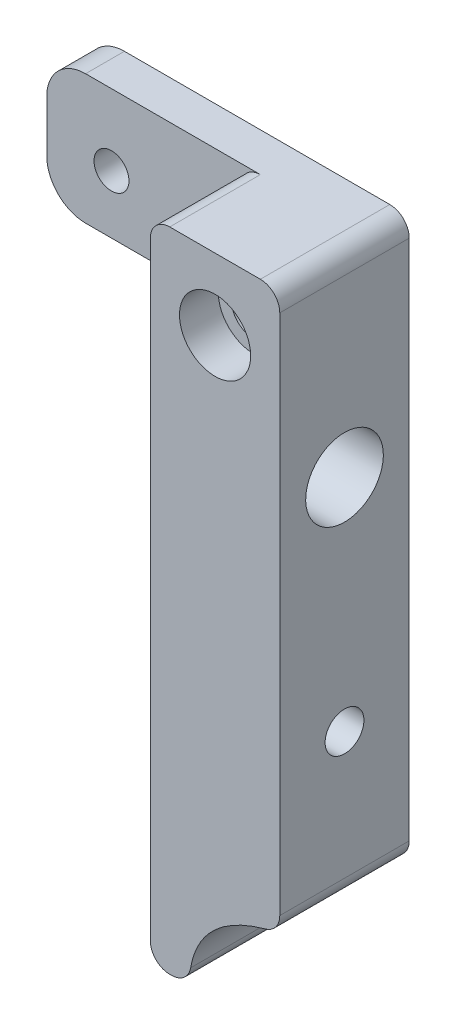
ISO-10303-21;
HEADER;
FILE_DESCRIPTION(('STEP AP214'),'2;1');
FILE_NAME('part.step','',(''),(''),'','','');
FILE_SCHEMA(('AUTOMOTIVE_DESIGN { 1 0 10303 214 1 1 1 1 }'));
ENDSEC;
DATA;
#1=APPLICATION_CONTEXT('core data for automotive mechanical design processes');
#2=APPLICATION_PROTOCOL_DEFINITION('international standard','automotive_design',2000,#1);
#3=PRODUCT_CONTEXT('',#1,'mechanical');
#4=PRODUCT('Part','Part','',(#3));
#5=PRODUCT_RELATED_PRODUCT_CATEGORY('part','',(#4));
#6=PRODUCT_DEFINITION_FORMATION('','',#4);
#7=PRODUCT_DEFINITION_CONTEXT('part definition',#1,'design');
#8=PRODUCT_DEFINITION('design','',#6,#7);
#9=PRODUCT_DEFINITION_SHAPE('','',#8);
#10=(LENGTH_UNIT() NAMED_UNIT(*) SI_UNIT(.MILLI.,.METRE.));
#11=(NAMED_UNIT(*) PLANE_ANGLE_UNIT() SI_UNIT($,.RADIAN.));
#12=(NAMED_UNIT(*) SI_UNIT($,.STERADIAN.) SOLID_ANGLE_UNIT());
#13=UNCERTAINTY_MEASURE_WITH_UNIT(LENGTH_MEASURE(1.E-05),#10,'distance_accuracy_value','');
#14=(GEOMETRIC_REPRESENTATION_CONTEXT(3) GLOBAL_UNCERTAINTY_ASSIGNED_CONTEXT((#13)) GLOBAL_UNIT_ASSIGNED_CONTEXT((#10,
#11,#12)) REPRESENTATION_CONTEXT('',''));
#15=CARTESIAN_POINT('',(0.,0.,0.));
#16=DIRECTION('',(0.,0.,1.));
#17=DIRECTION('',(1.,0.,0.));
#18=AXIS2_PLACEMENT_3D('',#15,#16,#17);
#19=CARTESIAN_POINT('',(-5.,25.,10.));
#20=DIRECTION('',(1.,0.,0.));
#21=DIRECTION('',(0.,1.,0.));
#22=AXIS2_PLACEMENT_3D('',#19,#20,#21);
#23=PLANE('',#22);
#24=CARTESIAN_POINT('',(-5.,-6.99999999999999,5.));
#25=DIRECTION('',(1.,0.,0.));
#26=DIRECTION('',(0.,1.,0.));
#27=AXIS2_PLACEMENT_3D('',#24,#25,#26);
#28=CIRCLE('',#27,1.5);
#29=CARTESIAN_POINT('',(-5.,-5.49999999999999,5.));
#30=VERTEX_POINT('',#29);
#31=EDGE_CURVE('E394',#30,#30,#28,.T.);
#32=ORIENTED_EDGE('',*,*,#31,.T.);
#33=EDGE_LOOP('',(#32));
#34=FACE_BOUND('',#33,.T.);
#35=CARTESIAN_POINT('',(-5.,10.,5.));
#36=DIRECTION('',(1.,0.,0.));
#37=DIRECTION('',(0.,1.,0.));
#38=AXIS2_PLACEMENT_3D('',#35,#36,#37);
#39=CIRCLE('',#38,3.);
#40=CARTESIAN_POINT('',(-5.,13.,5.));
#41=VERTEX_POINT('',#40);
#42=EDGE_CURVE('E183',#41,#41,#39,.T.);
#43=ORIENTED_EDGE('',*,*,#42,.T.);
#44=EDGE_LOOP('',(#43));
#45=FACE_BOUND('',#44,.T.);
#46=DIRECTION('',(0.,-1.,0.));
#47=VECTOR('',#46,1.);
#48=CARTESIAN_POINT('',(-5.,25.,10.));
#49=LINE('',#48,#47);
#50=CARTESIAN_POINT('',(-5.,23.5,10.));
#51=VERTEX_POINT('',#50);
#52=CARTESIAN_POINT('',(-5.,-23.5,10.));
#53=VERTEX_POINT('',#52);
#54=EDGE_CURVE('E291',#51,#53,#49,.T.);
#55=ORIENTED_EDGE('',*,*,#54,.F.);
#56=DIRECTION('',(0.,0.,-1.));
#57=VECTOR('',#56,1.);
#58=CARTESIAN_POINT('',(-5.,23.5,10.));
#59=LINE('',#58,#57);
#60=CARTESIAN_POINT('',(-5.,23.5,3.));
#61=VERTEX_POINT('',#60);
#62=EDGE_CURVE('E287',#51,#61,#59,.T.);
#63=ORIENTED_EDGE('',*,*,#62,.T.);
#64=DIRECTION('',(0.,1.,0.));
#65=VECTOR('',#64,1.);
#66=CARTESIAN_POINT('',(-5.,25.,3.));
#67=LINE('',#66,#65);
#68=CARTESIAN_POINT('',(-5.,15.,3.));
#69=VERTEX_POINT('',#68);
#70=EDGE_CURVE('E167',#69,#61,#67,.T.);
#71=ORIENTED_EDGE('',*,*,#70,.F.);
#72=DIRECTION('',(0.,0.,1.));
#73=VECTOR('',#72,1.);
#74=CARTESIAN_POINT('',(-5.,15.,0.));
#75=LINE('',#74,#73);
#76=CARTESIAN_POINT('',(-5.,15.,0.));
#77=VERTEX_POINT('',#76);
#78=EDGE_CURVE('E143',#77,#69,#75,.T.);
#79=ORIENTED_EDGE('',*,*,#78,.F.);
#80=DIRECTION('',(0.,-1.,0.));
#81=VECTOR('',#80,1.);
#82=CARTESIAN_POINT('',(-5.,25.,0.));
#83=LINE('',#82,#81);
#84=CARTESIAN_POINT('',(-5.,-23.5,0.));
#85=VERTEX_POINT('',#84);
#86=EDGE_CURVE('E152',#77,#85,#83,.T.);
#87=ORIENTED_EDGE('',*,*,#86,.T.);
#88=DIRECTION('',(0.,0.,-1.));
#89=VECTOR('',#88,1.);
#90=CARTESIAN_POINT('',(-5.,-23.5,10.));
#91=LINE('',#90,#89);
#92=EDGE_CURVE('E294',#85,#53,#91,.F.);
#93=ORIENTED_EDGE('',*,*,#92,.T.);
#94=EDGE_LOOP('',(#55,#63,#71,#79,#87,#93));
#95=FACE_BOUND('',#94,.T.);
#96=ADVANCED_FACE('F32',(#34,#45,#95),#23,.F.);
#97=CARTESIAN_POINT('',(0.,19.5,0.));
#98=DIRECTION('',(0.,0.,1.));
#99=DIRECTION('',(1.,0.,0.));
#100=AXIS2_PLACEMENT_3D('',#97,#98,#99);
#101=CYLINDRICAL_SURFACE('',#100,1.75);
#102=CARTESIAN_POINT('',(0.,19.5,0.));
#103=DIRECTION('',(0.,0.,1.));
#104=DIRECTION('',(1.,0.,0.));
#105=AXIS2_PLACEMENT_3D('',#102,#103,#104);
#106=CIRCLE('',#105,1.75);
#107=CARTESIAN_POINT('',(1.75,19.5,0.));
#108=VERTEX_POINT('',#107);
#109=EDGE_CURVE('E197',#108,#108,#106,.T.);
#110=ORIENTED_EDGE('',*,*,#109,.F.);
#111=EDGE_LOOP('',(#110));
#112=FACE_BOUND('',#111,.T.);
#113=CARTESIAN_POINT('',(0.,19.5,7.));
#114=DIRECTION('',(0.,0.,1.));
#115=DIRECTION('',(1.,0.,0.));
#116=AXIS2_PLACEMENT_3D('',#113,#114,#115);
#117=CIRCLE('',#116,1.75);
#118=CARTESIAN_POINT('',(1.75,19.5,7.));
#119=VERTEX_POINT('',#118);
#120=EDGE_CURVE('E187',#119,#119,#117,.F.);
#121=ORIENTED_EDGE('',*,*,#120,.F.);
#122=EDGE_LOOP('',(#121));
#123=FACE_BOUND('',#122,.T.);
#124=ADVANCED_FACE('F214',(#112,#123),#101,.F.);
#125=CARTESIAN_POINT('',(5.,25.,10.));
#126=DIRECTION('',(-1.,0.,0.));
#127=DIRECTION('',(0.,-1.,0.));
#128=AXIS2_PLACEMENT_3D('',#125,#126,#127);
#129=PLANE('',#128);
#130=CARTESIAN_POINT('',(5.,-6.99999999999999,5.));
#131=DIRECTION('',(1.,0.,0.));
#132=DIRECTION('',(0.,1.,0.));
#133=AXIS2_PLACEMENT_3D('',#130,#131,#132);
#134=CIRCLE('',#133,1.5);
#135=CARTESIAN_POINT('',(5.,-5.49999999999999,5.));
#136=VERTEX_POINT('',#135);
#137=EDGE_CURVE('E391',#136,#136,#134,.T.);
#138=ORIENTED_EDGE('',*,*,#137,.F.);
#139=EDGE_LOOP('',(#138));
#140=FACE_BOUND('',#139,.T.);
#141=CARTESIAN_POINT('',(5.,10.,5.));
#142=DIRECTION('',(1.,0.,0.));
#143=DIRECTION('',(0.,1.,0.));
#144=AXIS2_PLACEMENT_3D('',#141,#142,#143);
#145=CIRCLE('',#144,3.);
#146=CARTESIAN_POINT('',(5.,13.,5.));
#147=VERTEX_POINT('',#146);
#148=EDGE_CURVE('E148',#147,#147,#145,.T.);
#149=ORIENTED_EDGE('',*,*,#148,.F.);
#150=EDGE_LOOP('',(#149));
#151=FACE_BOUND('',#150,.T.);
#152=DIRECTION('',(0.,1.,0.));
#153=VECTOR('',#152,1.);
#154=CARTESIAN_POINT('',(5.,25.,10.));
#155=LINE('',#154,#153);
#156=CARTESIAN_POINT('',(5.,-16.8205775806911,10.));
#157=VERTEX_POINT('',#156);
#158=CARTESIAN_POINT('',(5.,23.5,10.));
#159=VERTEX_POINT('',#158);
#160=EDGE_CURVE('E345',#157,#159,#155,.T.);
#161=ORIENTED_EDGE('',*,*,#160,.F.);
#162=DIRECTION('',(0.,0.,1.));
#163=VECTOR('',#162,1.);
#164=CARTESIAN_POINT('',(5.,-16.8205775806911,10.));
#165=LINE('',#164,#163);
#166=CARTESIAN_POINT('',(5.,-16.8205775806911,0.));
#167=VERTEX_POINT('',#166);
#168=EDGE_CURVE('E327',#157,#167,#165,.F.);
#169=ORIENTED_EDGE('',*,*,#168,.T.);
#170=DIRECTION('',(0.,1.,0.));
#171=VECTOR('',#170,1.);
#172=CARTESIAN_POINT('',(5.,25.,0.));
#173=LINE('',#172,#171);
#174=CARTESIAN_POINT('',(5.,23.5,0.));
#175=VERTEX_POINT('',#174);
#176=EDGE_CURVE('E349',#167,#175,#173,.T.);
#177=ORIENTED_EDGE('',*,*,#176,.T.);
#178=DIRECTION('',(0.,0.,-1.));
#179=VECTOR('',#178,1.);
#180=CARTESIAN_POINT('',(5.,23.5,10.));
#181=LINE('',#180,#179);
#182=EDGE_CURVE('E329',#175,#159,#181,.F.);
#183=ORIENTED_EDGE('',*,*,#182,.T.);
#184=EDGE_LOOP('',(#161,#169,#177,#183));
#185=FACE_BOUND('',#184,.T.);
#186=ADVANCED_FACE('F217',(#140,#151,#185),#129,.F.);
#187=CARTESIAN_POINT('',(-5.,25.,10.));
#188=DIRECTION('',(0.,-1.,0.));
#189=DIRECTION('',(0.,0.,-1.));
#190=AXIS2_PLACEMENT_3D('',#187,#188,#189);
#191=PLANE('',#190);
#192=DIRECTION('',(1.,0.,0.));
#193=VECTOR('',#192,1.);
#194=CARTESIAN_POINT('',(-20.,25.,3.));
#195=LINE('',#194,#193);
#196=CARTESIAN_POINT('',(-17.,25.,3.));
#197=VERTEX_POINT('',#196);
#198=CARTESIAN_POINT('',(-3.5,25.,3.));
#199=VERTEX_POINT('',#198);
#200=EDGE_CURVE('E47',#197,#199,#195,.T.);
#201=ORIENTED_EDGE('',*,*,#200,.T.);
#202=DIRECTION('',(0.,0.,-1.));
#203=VECTOR('',#202,1.);
#204=CARTESIAN_POINT('',(-3.5,25.,10.));
#205=LINE('',#204,#203);
#206=CARTESIAN_POINT('',(-3.5,25.,10.));
#207=VERTEX_POINT('',#206);
#208=EDGE_CURVE('E51',#199,#207,#205,.F.);
#209=ORIENTED_EDGE('',*,*,#208,.T.);
#210=DIRECTION('',(-1.,0.,0.));
#211=VECTOR('',#210,1.);
#212=CARTESIAN_POINT('',(-5.,25.,10.));
#213=LINE('',#212,#211);
#214=CARTESIAN_POINT('',(3.5,25.,10.));
#215=VERTEX_POINT('',#214);
#216=EDGE_CURVE('E292',#215,#207,#213,.T.);
#217=ORIENTED_EDGE('',*,*,#216,.F.);
#218=DIRECTION('',(0.,0.,-1.));
#219=VECTOR('',#218,1.);
#220=CARTESIAN_POINT('',(3.5,25.,10.));
#221=LINE('',#220,#219);
#222=CARTESIAN_POINT('',(3.5,25.,0.));
#223=VERTEX_POINT('',#222);
#224=EDGE_CURVE('E305',#215,#223,#221,.T.);
#225=ORIENTED_EDGE('',*,*,#224,.T.);
#226=DIRECTION('',(-1.,0.,0.));
#227=VECTOR('',#226,1.);
#228=CARTESIAN_POINT('',(-5.,25.,0.));
#229=LINE('',#228,#227);
#230=CARTESIAN_POINT('',(-17.,25.,0.));
#231=VERTEX_POINT('',#230);
#232=EDGE_CURVE('E161',#223,#231,#229,.T.);
#233=ORIENTED_EDGE('',*,*,#232,.T.);
#234=DIRECTION('',(0.,0.,-1.));
#235=VECTOR('',#234,1.);
#236=CARTESIAN_POINT('',(-17.,25.,3.));
#237=LINE('',#236,#235);
#238=EDGE_CURVE('E275',#231,#197,#237,.F.);
#239=ORIENTED_EDGE('',*,*,#238,.T.);
#240=EDGE_LOOP('',(#201,#209,#217,#225,#233,#239));
#241=FACE_BOUND('',#240,.T.);
#242=ADVANCED_FACE('F229',(#241),#191,.F.);
#243=CARTESIAN_POINT('',(-5.,-25.,10.));
#244=DIRECTION('',(0.,1.,0.));
#245=DIRECTION('',(0.,0.,1.));
#246=AXIS2_PLACEMENT_3D('',#243,#244,#245);
#247=PLANE('',#246);
#248=DIRECTION('',(1.,0.,0.));
#249=VECTOR('',#248,1.);
#250=CARTESIAN_POINT('',(-5.,-25.,0.));
#251=LINE('',#250,#249);
#252=CARTESIAN_POINT('',(-3.5,-25.,0.));
#253=VERTEX_POINT('',#252);
#254=CARTESIAN_POINT('',(-3.36282393672585,-25.,0.));
#255=VERTEX_POINT('',#254);
#256=EDGE_CURVE('E160',#253,#255,#251,.T.);
#257=ORIENTED_EDGE('',*,*,#256,.T.);
#258=DIRECTION('',(0.,0.,1.));
#259=VECTOR('',#258,1.);
#260=CARTESIAN_POINT('',(-3.36282393672585,-25.,10.));
#261=LINE('',#260,#259);
#262=CARTESIAN_POINT('',(-3.36282393672585,-25.,10.));
#263=VERTEX_POINT('',#262);
#264=EDGE_CURVE('E314',#255,#263,#261,.T.);
#265=ORIENTED_EDGE('',*,*,#264,.T.);
#266=DIRECTION('',(1.,0.,0.));
#267=VECTOR('',#266,1.);
#268=CARTESIAN_POINT('',(-5.,-25.,10.));
#269=LINE('',#268,#267);
#270=CARTESIAN_POINT('',(-3.5,-25.,10.));
#271=VERTEX_POINT('',#270);
#272=EDGE_CURVE('E296',#271,#263,#269,.T.);
#273=ORIENTED_EDGE('',*,*,#272,.F.);
#274=DIRECTION('',(0.,0.,-1.));
#275=VECTOR('',#274,1.);
#276=CARTESIAN_POINT('',(-3.5,-25.,10.));
#277=LINE('',#276,#275);
#278=EDGE_CURVE('E317',#271,#253,#277,.T.);
#279=ORIENTED_EDGE('',*,*,#278,.T.);
#280=EDGE_LOOP('',(#257,#265,#273,#279));
#281=FACE_BOUND('',#280,.T.);
#282=ADVANCED_FACE('F222',(#281),#247,.F.);
#283=CARTESIAN_POINT('',(0.,0.,10.));
#284=DIRECTION('',(0.,0.,1.));
#285=DIRECTION('',(1.,0.,0.));
#286=AXIS2_PLACEMENT_3D('',#283,#284,#285);
#287=PLANE('',#286);
#288=CARTESIAN_POINT('',(0.,19.5,10.));
#289=DIRECTION('',(0.,0.,1.));
#290=DIRECTION('',(1.,0.,0.));
#291=AXIS2_PLACEMENT_3D('',#288,#289,#290);
#292=CIRCLE('',#291,2.75);
#293=CARTESIAN_POINT('',(2.75,19.5,10.));
#294=VERTEX_POINT('',#293);
#295=EDGE_CURVE('E188',#294,#294,#292,.T.);
#296=ORIENTED_EDGE('',*,*,#295,.F.);
#297=EDGE_LOOP('',(#296));
#298=FACE_BOUND('',#297,.T.);
#299=ORIENTED_EDGE('',*,*,#216,.T.);
#300=CARTESIAN_POINT('',(-3.5,23.5,10.));
#301=DIRECTION('',(0.,0.,1.));
#302=DIRECTION('',(1.,0.,0.));
#303=AXIS2_PLACEMENT_3D('',#300,#301,#302);
#304=CIRCLE('',#303,1.5);
#305=EDGE_CURVE('E40',#207,#51,#304,.T.);
#306=ORIENTED_EDGE('',*,*,#305,.T.);
#307=ORIENTED_EDGE('',*,*,#54,.T.);
#308=CARTESIAN_POINT('',(-3.5,-23.5,10.));
#309=DIRECTION('',(0.,0.,1.));
#310=DIRECTION('',(1.,0.,0.));
#311=AXIS2_PLACEMENT_3D('',#308,#309,#310);
#312=CIRCLE('',#311,1.5);
#313=EDGE_CURVE('E335',#53,#271,#312,.T.);
#314=ORIENTED_EDGE('',*,*,#313,.T.);
#315=ORIENTED_EDGE('',*,*,#272,.T.);
#316=CARTESIAN_POINT('',(-3.36282393672585,-23.5,10.));
#317=DIRECTION('',(0.,0.,1.));
#318=DIRECTION('',(1.,0.,0.));
#319=AXIS2_PLACEMENT_3D('',#316,#317,#318);
#320=CIRCLE('',#319,1.5);
#321=CARTESIAN_POINT('',(-1.88522685811019,-23.7582767377571,10.));
#322=VERTEX_POINT('',#321);
#323=EDGE_CURVE('E333',#263,#322,#320,.T.);
#324=ORIENTED_EDGE('',*,*,#323,.T.);
#325=CARTESIAN_POINT('',(5.,-18.,10.));
#326=CARTESIAN_POINT('',(-1.90422484156133,-19.4309354552699,10.));
#327=CARTESIAN_POINT('',(-2.,-25.,10.));
#328=B_SPLINE_CURVE_WITH_KNOTS('',2,(#325,#326,#327),.UNSPECIFIED.,.F.,.F.,(3,3),(0.,1.),.UNSPECIFIED.);
#329=CARTESIAN_POINT('',(3.90400517645005,-18.2651466574062,10.));
#330=VERTEX_POINT('',#329);
#331=EDGE_CURVE('E198',#330,#322,#328,.T.);
#332=ORIENTED_EDGE('',*,*,#331,.F.);
#333=CARTESIAN_POINT('',(3.5,-16.8205775806911,10.));
#334=DIRECTION('',(0.,0.,1.));
#335=DIRECTION('',(1.,0.,0.));
#336=AXIS2_PLACEMENT_3D('',#333,#334,#335);
#337=CIRCLE('',#336,1.5);
#338=EDGE_CURVE('E331',#330,#157,#337,.T.);
#339=ORIENTED_EDGE('',*,*,#338,.T.);
#340=ORIENTED_EDGE('',*,*,#160,.T.);
#341=CARTESIAN_POINT('',(3.5,23.5,10.));
#342=DIRECTION('',(0.,0.,1.));
#343=DIRECTION('',(1.,0.,0.));
#344=AXIS2_PLACEMENT_3D('',#341,#342,#343);
#345=CIRCLE('',#344,1.5);
#346=EDGE_CURVE('E337',#159,#215,#345,.T.);
#347=ORIENTED_EDGE('',*,*,#346,.T.);
#348=EDGE_LOOP('',(#299,#306,#307,#314,#315,#324,#332,#339,#340,#347));
#349=FACE_BOUND('',#348,.T.);
#350=ADVANCED_FACE('F219',(#298,#349),#287,.T.);
#351=CARTESIAN_POINT('',(0.,0.,0.));
#352=DIRECTION('',(0.,0.,1.));
#353=DIRECTION('',(1.,0.,0.));
#354=AXIS2_PLACEMENT_3D('',#351,#352,#353);
#355=PLANE('',#354);
#356=CARTESIAN_POINT('',(-15.,19.5,0.));
#357=DIRECTION('',(0.,0.,1.));
#358=DIRECTION('',(1.,0.,0.));
#359=AXIS2_PLACEMENT_3D('',#356,#357,#358);
#360=CIRCLE('',#359,1.35);
#361=CARTESIAN_POINT('',(-13.65,19.5,0.));
#362=VERTEX_POINT('',#361);
#363=EDGE_CURVE('E168',#362,#362,#360,.T.);
#364=ORIENTED_EDGE('',*,*,#363,.T.);
#365=EDGE_LOOP('',(#364));
#366=FACE_BOUND('',#365,.T.);
#367=ORIENTED_EDGE('',*,*,#109,.T.);
#368=EDGE_LOOP('',(#367));
#369=FACE_BOUND('',#368,.T.);
#370=DIRECTION('',(0.,-1.,0.));
#371=VECTOR('',#370,1.);
#372=CARTESIAN_POINT('',(-20.,25.,0.));
#373=LINE('',#372,#371);
#374=CARTESIAN_POINT('',(-20.,22.,0.));
#375=VERTEX_POINT('',#374);
#376=CARTESIAN_POINT('',(-20.,18.,0.));
#377=VERTEX_POINT('',#376);
#378=EDGE_CURVE('E170',#375,#377,#373,.T.);
#379=ORIENTED_EDGE('',*,*,#378,.F.);
#380=CARTESIAN_POINT('',(-17.,22.,0.));
#381=DIRECTION('',(0.,0.,1.));
#382=DIRECTION('',(1.,0.,0.));
#383=AXIS2_PLACEMENT_3D('',#380,#381,#382);
#384=CIRCLE('',#383,3.);
#385=EDGE_CURVE('E272',#375,#231,#384,.F.);
#386=ORIENTED_EDGE('',*,*,#385,.T.);
#387=ORIENTED_EDGE('',*,*,#232,.F.);
#388=CARTESIAN_POINT('',(3.5,23.5,0.));
#389=DIRECTION('',(0.,0.,1.));
#390=DIRECTION('',(1.,0.,0.));
#391=AXIS2_PLACEMENT_3D('',#388,#389,#390);
#392=CIRCLE('',#391,1.5);
#393=EDGE_CURVE('E325',#223,#175,#392,.F.);
#394=ORIENTED_EDGE('',*,*,#393,.T.);
#395=ORIENTED_EDGE('',*,*,#176,.F.);
#396=CARTESIAN_POINT('',(3.5,-16.8205775806911,0.));
#397=DIRECTION('',(0.,0.,1.));
#398=DIRECTION('',(1.,0.,0.));
#399=AXIS2_PLACEMENT_3D('',#396,#397,#398);
#400=CIRCLE('',#399,1.5);
#401=CARTESIAN_POINT('',(3.90400517645005,-18.2651466574062,0.));
#402=VERTEX_POINT('',#401);
#403=EDGE_CURVE('E320',#167,#402,#400,.F.);
#404=ORIENTED_EDGE('',*,*,#403,.T.);
#405=CARTESIAN_POINT('',(5.,-18.,0.));
#406=CARTESIAN_POINT('',(-1.90422484156133,-19.4309354552699,0.));
#407=CARTESIAN_POINT('',(-2.,-25.,0.));
#408=B_SPLINE_CURVE_WITH_KNOTS('',2,(#405,#406,#407),.UNSPECIFIED.,.F.,.F.,(3,3),(0.,1.),.UNSPECIFIED.);
#409=CARTESIAN_POINT('',(-1.88522685811019,-23.7582767377571,0.));
#410=VERTEX_POINT('',#409);
#411=EDGE_CURVE('E191',#402,#410,#408,.T.);
#412=ORIENTED_EDGE('',*,*,#411,.T.);
#413=CARTESIAN_POINT('',(-3.36282393672585,-23.5,0.));
#414=DIRECTION('',(0.,0.,1.));
#415=DIRECTION('',(1.,0.,0.));
#416=AXIS2_PLACEMENT_3D('',#413,#414,#415);
#417=CIRCLE('',#416,1.5);
#418=EDGE_CURVE('E322',#410,#255,#417,.F.);
#419=ORIENTED_EDGE('',*,*,#418,.T.);
#420=ORIENTED_EDGE('',*,*,#256,.F.);
#421=CARTESIAN_POINT('',(-3.5,-23.5,0.));
#422=DIRECTION('',(0.,0.,1.));
#423=DIRECTION('',(1.,0.,0.));
#424=AXIS2_PLACEMENT_3D('',#421,#422,#423);
#425=CIRCLE('',#424,1.5);
#426=EDGE_CURVE('E156',#253,#85,#425,.F.);
#427=ORIENTED_EDGE('',*,*,#426,.T.);
#428=ORIENTED_EDGE('',*,*,#86,.F.);
#429=DIRECTION('',(1.,0.,0.));
#430=VECTOR('',#429,1.);
#431=CARTESIAN_POINT('',(-20.,15.,0.));
#432=LINE('',#431,#430);
#433=CARTESIAN_POINT('',(-17.,15.,0.));
#434=VERTEX_POINT('',#433);
#435=EDGE_CURVE('E138',#434,#77,#432,.T.);
#436=ORIENTED_EDGE('',*,*,#435,.F.);
#437=CARTESIAN_POINT('',(-17.,18.,0.));
#438=DIRECTION('',(0.,0.,1.));
#439=DIRECTION('',(1.,0.,0.));
#440=AXIS2_PLACEMENT_3D('',#437,#438,#439);
#441=CIRCLE('',#440,3.);
#442=EDGE_CURVE('E268',#434,#377,#441,.F.);
#443=ORIENTED_EDGE('',*,*,#442,.T.);
#444=EDGE_LOOP('',(#379,#386,#387,#394,#395,#404,#412,#419,#420,#427,#428,#436,#443));
#445=FACE_BOUND('',#444,.T.);
#446=ADVANCED_FACE('F154',(#366,#369,#445),#355,.F.);
#447=DIRECTION('',(0.,0.,1.));
#448=VECTOR('',#447,1.);
#449=SURFACE_OF_LINEAR_EXTRUSION('',#408,#448);
#450=ORIENTED_EDGE('',*,*,#411,.F.);
#451=DIRECTION('',(0.,0.,1.));
#452=VECTOR('',#451,1.);
#453=CARTESIAN_POINT('',(3.90400517645005,-18.2651466574062,0.));
#454=LINE('',#453,#452);
#455=EDGE_CURVE('E339',#402,#330,#454,.T.);
#456=ORIENTED_EDGE('',*,*,#455,.T.);
#457=ORIENTED_EDGE('',*,*,#331,.T.);
#458=DIRECTION('',(0.,0.,1.));
#459=VECTOR('',#458,1.);
#460=CARTESIAN_POINT('',(-1.88522685811019,-23.7582767377571,10.));
#461=LINE('',#460,#459);
#462=EDGE_CURVE('E342',#322,#410,#461,.F.);
#463=ORIENTED_EDGE('',*,*,#462,.T.);
#464=EDGE_LOOP('',(#450,#456,#457,#463));
#465=FACE_BOUND('',#464,.T.);
#466=ADVANCED_FACE('F206',(#465),#449,.F.);
#467=CARTESIAN_POINT('',(3.5,-16.8205775806911,5.));
#468=DIRECTION('',(0.,0.,1.));
#469=DIRECTION('',(1.,0.,0.));
#470=AXIS2_PLACEMENT_3D('',#467,#468,#469);
#471=CYLINDRICAL_SURFACE('',#470,1.5);
#472=ORIENTED_EDGE('',*,*,#403,.F.);
#473=ORIENTED_EDGE('',*,*,#168,.F.);
#474=ORIENTED_EDGE('',*,*,#338,.F.);
#475=ORIENTED_EDGE('',*,*,#455,.F.);
#476=EDGE_LOOP('',(#472,#473,#474,#475));
#477=FACE_BOUND('',#476,.T.);
#478=ADVANCED_FACE('F210',(#477),#471,.T.);
#479=CARTESIAN_POINT('',(-3.36282393672585,-23.5,5.));
#480=DIRECTION('',(0.,0.,1.));
#481=DIRECTION('',(1.,0.,0.));
#482=AXIS2_PLACEMENT_3D('',#479,#480,#481);
#483=CYLINDRICAL_SURFACE('',#482,1.5);
#484=ORIENTED_EDGE('',*,*,#418,.F.);
#485=ORIENTED_EDGE('',*,*,#462,.F.);
#486=ORIENTED_EDGE('',*,*,#323,.F.);
#487=ORIENTED_EDGE('',*,*,#264,.F.);
#488=EDGE_LOOP('',(#484,#485,#486,#487));
#489=FACE_BOUND('',#488,.T.);
#490=ADVANCED_FACE('F241',(#489),#483,.T.);
#491=CARTESIAN_POINT('',(-3.5,-23.5,10.));
#492=DIRECTION('',(0.,0.,-1.));
#493=DIRECTION('',(-1.,0.,0.));
#494=AXIS2_PLACEMENT_3D('',#491,#492,#493);
#495=CYLINDRICAL_SURFACE('',#494,1.5);
#496=ORIENTED_EDGE('',*,*,#313,.F.);
#497=ORIENTED_EDGE('',*,*,#92,.F.);
#498=ORIENTED_EDGE('',*,*,#426,.F.);
#499=ORIENTED_EDGE('',*,*,#278,.F.);
#500=EDGE_LOOP('',(#496,#497,#498,#499));
#501=FACE_BOUND('',#500,.T.);
#502=ADVANCED_FACE('F245',(#501),#495,.T.);
#503=CARTESIAN_POINT('',(3.5,23.5,10.));
#504=DIRECTION('',(0.,0.,-1.));
#505=DIRECTION('',(-1.,0.,0.));
#506=AXIS2_PLACEMENT_3D('',#503,#504,#505);
#507=CYLINDRICAL_SURFACE('',#506,1.5);
#508=ORIENTED_EDGE('',*,*,#346,.F.);
#509=ORIENTED_EDGE('',*,*,#182,.F.);
#510=ORIENTED_EDGE('',*,*,#393,.F.);
#511=ORIENTED_EDGE('',*,*,#224,.F.);
#512=EDGE_LOOP('',(#508,#509,#510,#511));
#513=FACE_BOUND('',#512,.T.);
#514=ADVANCED_FACE('F249',(#513),#507,.T.);
#515=CARTESIAN_POINT('',(0.,19.5,7.));
#516=DIRECTION('',(0.,0.,1.));
#517=DIRECTION('',(1.,0.,0.));
#518=AXIS2_PLACEMENT_3D('',#515,#516,#517);
#519=PLANE('',#518);
#520=CARTESIAN_POINT('',(0.,19.5,7.));
#521=DIRECTION('',(0.,0.,1.));
#522=DIRECTION('',(1.,0.,0.));
#523=AXIS2_PLACEMENT_3D('',#520,#521,#522);
#524=CIRCLE('',#523,2.75);
#525=CARTESIAN_POINT('',(2.75,19.5,7.));
#526=VERTEX_POINT('',#525);
#527=EDGE_CURVE('E184',#526,#526,#524,.T.);
#528=ORIENTED_EDGE('',*,*,#527,.T.);
#529=EDGE_LOOP('',(#528));
#530=FACE_BOUND('',#529,.T.);
#531=ORIENTED_EDGE('',*,*,#120,.T.);
#532=EDGE_LOOP('',(#531));
#533=FACE_BOUND('',#532,.T.);
#534=ADVANCED_FACE('F253',(#530,#533),#519,.T.);
#535=CARTESIAN_POINT('',(0.,19.5,7.));
#536=DIRECTION('',(0.,0.,1.));
#537=DIRECTION('',(1.,0.,0.));
#538=AXIS2_PLACEMENT_3D('',#535,#536,#537);
#539=CYLINDRICAL_SURFACE('',#538,2.75);
#540=ORIENTED_EDGE('',*,*,#527,.F.);
#541=EDGE_LOOP('',(#540));
#542=FACE_BOUND('',#541,.T.);
#543=ORIENTED_EDGE('',*,*,#295,.T.);
#544=EDGE_LOOP('',(#543));
#545=FACE_BOUND('',#544,.T.);
#546=ADVANCED_FACE('F212',(#542,#545),#539,.F.);
#547=CARTESIAN_POINT('',(-8.,10.,5.));
#548=DIRECTION('',(1.,0.,0.));
#549=DIRECTION('',(0.,1.,0.));
#550=AXIS2_PLACEMENT_3D('',#547,#548,#549);
#551=CYLINDRICAL_SURFACE('',#550,3.);
#552=ORIENTED_EDGE('',*,*,#148,.T.);
#553=EDGE_LOOP('',(#552));
#554=FACE_BOUND('',#553,.T.);
#555=ORIENTED_EDGE('',*,*,#42,.F.);
#556=EDGE_LOOP('',(#555));
#557=FACE_BOUND('',#556,.T.);
#558=ADVANCED_FACE('F367',(#554,#557),#551,.F.);
#559=CARTESIAN_POINT('',(-20.,15.,0.));
#560=DIRECTION('',(0.,1.,0.));
#561=DIRECTION('',(-1.,0.,0.));
#562=AXIS2_PLACEMENT_3D('',#559,#560,#561);
#563=PLANE('',#562);
#564=DIRECTION('',(1.,0.,0.));
#565=VECTOR('',#564,1.);
#566=CARTESIAN_POINT('',(-20.,15.,3.));
#567=LINE('',#566,#565);
#568=CARTESIAN_POINT('',(-17.,15.,3.));
#569=VERTEX_POINT('',#568);
#570=EDGE_CURVE('E149',#569,#69,#567,.T.);
#571=ORIENTED_EDGE('',*,*,#570,.F.);
#572=DIRECTION('',(0.,0.,1.));
#573=VECTOR('',#572,1.);
#574=CARTESIAN_POINT('',(-17.,15.,0.));
#575=LINE('',#574,#573);
#576=EDGE_CURVE('E145',#569,#434,#575,.F.);
#577=ORIENTED_EDGE('',*,*,#576,.T.);
#578=ORIENTED_EDGE('',*,*,#435,.T.);
#579=ORIENTED_EDGE('',*,*,#78,.T.);
#580=EDGE_LOOP('',(#571,#577,#578,#579));
#581=FACE_BOUND('',#580,.T.);
#582=ADVANCED_FACE('F141',(#581),#563,.F.);
#583=CARTESIAN_POINT('',(-20.,25.,3.));
#584=DIRECTION('',(0.,0.,-1.));
#585=DIRECTION('',(0.,1.,0.));
#586=AXIS2_PLACEMENT_3D('',#583,#584,#585);
#587=PLANE('',#586);
#588=CARTESIAN_POINT('',(-15.,19.5,3.));
#589=DIRECTION('',(0.,0.,1.));
#590=DIRECTION('',(1.,0.,0.));
#591=AXIS2_PLACEMENT_3D('',#588,#589,#590);
#592=CIRCLE('',#591,1.35);
#593=CARTESIAN_POINT('',(-13.65,19.5,3.));
#594=VERTEX_POINT('',#593);
#595=EDGE_CURVE('E173',#594,#594,#592,.T.);
#596=ORIENTED_EDGE('',*,*,#595,.F.);
#597=EDGE_LOOP('',(#596));
#598=FACE_BOUND('',#597,.T.);
#599=ORIENTED_EDGE('',*,*,#200,.F.);
#600=CARTESIAN_POINT('',(-17.,22.,3.));
#601=DIRECTION('',(0.,0.,-1.));
#602=DIRECTION('',(0.,1.,0.));
#603=AXIS2_PLACEMENT_3D('',#600,#601,#602);
#604=CIRCLE('',#603,3.);
#605=CARTESIAN_POINT('',(-20.,22.,3.));
#606=VERTEX_POINT('',#605);
#607=EDGE_CURVE('E284',#197,#606,#604,.F.);
#608=ORIENTED_EDGE('',*,*,#607,.T.);
#609=DIRECTION('',(0.,1.,0.));
#610=VECTOR('',#609,1.);
#611=CARTESIAN_POINT('',(-20.,25.,3.));
#612=LINE('',#611,#610);
#613=CARTESIAN_POINT('',(-20.,18.,3.));
#614=VERTEX_POINT('',#613);
#615=EDGE_CURVE('E176',#614,#606,#612,.T.);
#616=ORIENTED_EDGE('',*,*,#615,.F.);
#617=CARTESIAN_POINT('',(-17.,18.,3.));
#618=DIRECTION('',(0.,0.,-1.));
#619=DIRECTION('',(0.,1.,0.));
#620=AXIS2_PLACEMENT_3D('',#617,#618,#619);
#621=CIRCLE('',#620,3.);
#622=EDGE_CURVE('E282',#614,#569,#621,.F.);
#623=ORIENTED_EDGE('',*,*,#622,.T.);
#624=ORIENTED_EDGE('',*,*,#570,.T.);
#625=ORIENTED_EDGE('',*,*,#70,.T.);
#626=CARTESIAN_POINT('',(-3.5,23.5,3.));
#627=DIRECTION('',(0.,0.,-1.));
#628=DIRECTION('',(0.,1.,0.));
#629=AXIS2_PLACEMENT_3D('',#626,#627,#628);
#630=CIRCLE('',#629,1.5);
#631=EDGE_CURVE('E11',#61,#199,#630,.T.);
#632=ORIENTED_EDGE('',*,*,#631,.T.);
#633=EDGE_LOOP('',(#599,#608,#616,#623,#624,#625,#632));
#634=FACE_BOUND('',#633,.T.);
#635=ADVANCED_FACE('F299',(#598,#634),#587,.F.);
#636=CARTESIAN_POINT('',(-20.,0.,0.));
#637=DIRECTION('',(-1.,0.,0.));
#638=DIRECTION('',(0.,-1.,0.));
#639=AXIS2_PLACEMENT_3D('',#636,#637,#638);
#640=PLANE('',#639);
#641=ORIENTED_EDGE('',*,*,#615,.T.);
#642=DIRECTION('',(0.,0.,-1.));
#643=VECTOR('',#642,1.);
#644=CARTESIAN_POINT('',(-20.,22.,0.));
#645=LINE('',#644,#643);
#646=EDGE_CURVE('E273',#606,#375,#645,.T.);
#647=ORIENTED_EDGE('',*,*,#646,.T.);
#648=ORIENTED_EDGE('',*,*,#378,.T.);
#649=DIRECTION('',(0.,0.,1.));
#650=VECTOR('',#649,1.);
#651=CARTESIAN_POINT('',(-20.,18.,3.));
#652=LINE('',#651,#650);
#653=EDGE_CURVE('E270',#377,#614,#652,.T.);
#654=ORIENTED_EDGE('',*,*,#653,.T.);
#655=EDGE_LOOP('',(#641,#647,#648,#654));
#656=FACE_BOUND('',#655,.T.);
#657=ADVANCED_FACE('F258',(#656),#640,.T.);
#658=CARTESIAN_POINT('',(-17.,22.,0.));
#659=DIRECTION('',(0.,0.,1.));
#660=DIRECTION('',(1.,0.,0.));
#661=AXIS2_PLACEMENT_3D('',#658,#659,#660);
#662=CYLINDRICAL_SURFACE('',#661,3.);
#663=ORIENTED_EDGE('',*,*,#607,.F.);
#664=ORIENTED_EDGE('',*,*,#238,.F.);
#665=ORIENTED_EDGE('',*,*,#385,.F.);
#666=ORIENTED_EDGE('',*,*,#646,.F.);
#667=EDGE_LOOP('',(#663,#664,#665,#666));
#668=FACE_BOUND('',#667,.T.);
#669=ADVANCED_FACE('F255',(#668),#662,.T.);
#670=CARTESIAN_POINT('',(-17.,18.,0.));
#671=DIRECTION('',(0.,0.,-1.));
#672=DIRECTION('',(-1.,0.,0.));
#673=AXIS2_PLACEMENT_3D('',#670,#671,#672);
#674=CYLINDRICAL_SURFACE('',#673,3.);
#675=ORIENTED_EDGE('',*,*,#442,.F.);
#676=ORIENTED_EDGE('',*,*,#576,.F.);
#677=ORIENTED_EDGE('',*,*,#622,.F.);
#678=ORIENTED_EDGE('',*,*,#653,.F.);
#679=EDGE_LOOP('',(#675,#676,#677,#678));
#680=FACE_BOUND('',#679,.T.);
#681=ADVANCED_FACE('F257',(#680),#674,.T.);
#682=CARTESIAN_POINT('',(-3.5,23.5,10.));
#683=DIRECTION('',(0.,0.,-1.));
#684=DIRECTION('',(-1.,0.,0.));
#685=AXIS2_PLACEMENT_3D('',#682,#683,#684);
#686=CYLINDRICAL_SURFACE('',#685,1.5);
#687=ORIENTED_EDGE('',*,*,#305,.F.);
#688=ORIENTED_EDGE('',*,*,#208,.F.);
#689=ORIENTED_EDGE('',*,*,#631,.F.);
#690=ORIENTED_EDGE('',*,*,#62,.F.);
#691=EDGE_LOOP('',(#687,#688,#689,#690));
#692=FACE_BOUND('',#691,.T.);
#693=ADVANCED_FACE('F34',(#692),#686,.T.);
#694=CARTESIAN_POINT('',(-15.,19.5,-12.));
#695=DIRECTION('',(0.,0.,1.));
#696=DIRECTION('',(1.,0.,0.));
#697=AXIS2_PLACEMENT_3D('',#694,#695,#696);
#698=CYLINDRICAL_SURFACE('',#697,1.35);
#699=ORIENTED_EDGE('',*,*,#595,.T.);
#700=EDGE_LOOP('',(#699));
#701=FACE_BOUND('',#700,.T.);
#702=ORIENTED_EDGE('',*,*,#363,.F.);
#703=EDGE_LOOP('',(#702));
#704=FACE_BOUND('',#703,.T.);
#705=ADVANCED_FACE('F265',(#701,#704),#698,.F.);
#706=CARTESIAN_POINT('',(-10.,-6.99999999999999,5.));
#707=DIRECTION('',(1.,0.,0.));
#708=DIRECTION('',(0.,1.,0.));
#709=AXIS2_PLACEMENT_3D('',#706,#707,#708);
#710=CYLINDRICAL_SURFACE('',#709,1.5);
#711=ORIENTED_EDGE('',*,*,#137,.T.);
#712=EDGE_LOOP('',(#711));
#713=FACE_BOUND('',#712,.T.);
#714=ORIENTED_EDGE('',*,*,#31,.F.);
#715=EDGE_LOOP('',(#714));
#716=FACE_BOUND('',#715,.T.);
#717=ADVANCED_FACE('F382',(#713,#716),#710,.F.);
#718=CLOSED_SHELL('',(#96,#124,#186,#242,#282,#350,#446,#466,#478,#490,#502,#514,#534,#546,#558,
#582,#635,#657,#669,#681,#693,#705,#717));
#719=MANIFOLD_SOLID_BREP('B2',#718);
#720=ADVANCED_BREP_SHAPE_REPRESENTATION('',(#18,#719),#14);
#721=SHAPE_DEFINITION_REPRESENTATION(#9,#720);
ENDSEC;
END-ISO-10303-21;
